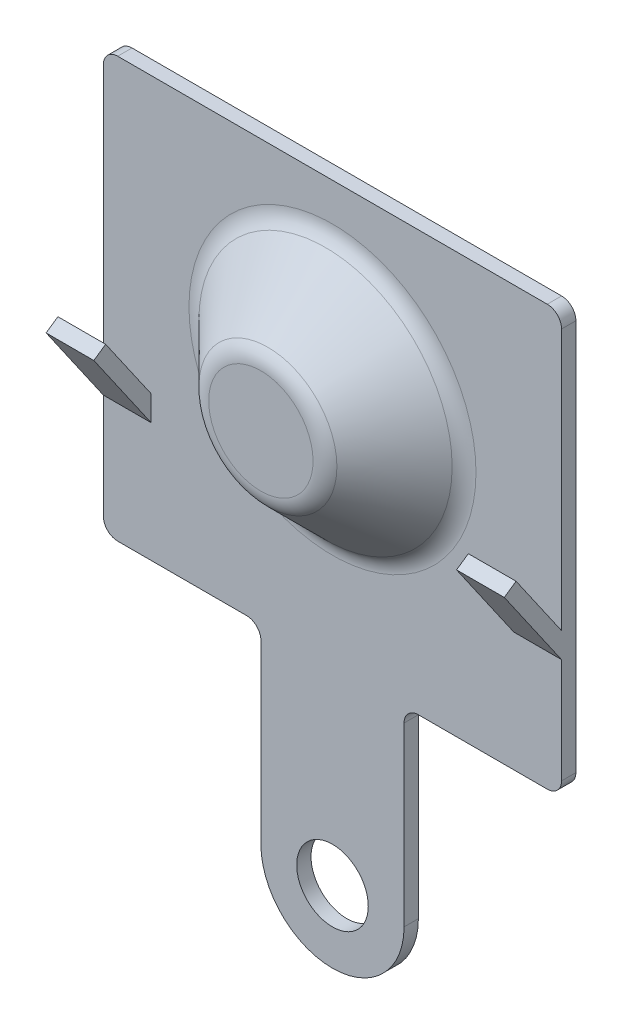
ISO-10303-21;
HEADER;
FILE_DESCRIPTION(('STEP AP214'),'2;1');
FILE_NAME('part.step','',(''),(''),'','','');
FILE_SCHEMA(('AUTOMOTIVE_DESIGN { 1 0 10303 214 1 1 1 1 }'));
ENDSEC;
DATA;
#1=APPLICATION_CONTEXT('core data for automotive mechanical design processes');
#2=APPLICATION_PROTOCOL_DEFINITION('international standard','automotive_design',2000,#1);
#3=PRODUCT_CONTEXT('',#1,'mechanical');
#4=PRODUCT('Part','Part','',(#3));
#5=PRODUCT_RELATED_PRODUCT_CATEGORY('part','',(#4));
#6=PRODUCT_DEFINITION_FORMATION('','',#4);
#7=PRODUCT_DEFINITION_CONTEXT('part definition',#1,'design');
#8=PRODUCT_DEFINITION('design','',#6,#7);
#9=PRODUCT_DEFINITION_SHAPE('','',#8);
#10=(LENGTH_UNIT() NAMED_UNIT(*) SI_UNIT(.MILLI.,.METRE.));
#11=(NAMED_UNIT(*) PLANE_ANGLE_UNIT() SI_UNIT($,.RADIAN.));
#12=(NAMED_UNIT(*) SI_UNIT($,.STERADIAN.) SOLID_ANGLE_UNIT());
#13=UNCERTAINTY_MEASURE_WITH_UNIT(LENGTH_MEASURE(1.E-05),#10,'distance_accuracy_value','');
#14=(GEOMETRIC_REPRESENTATION_CONTEXT(3) GLOBAL_UNCERTAINTY_ASSIGNED_CONTEXT((#13)) GLOBAL_UNIT_ASSIGNED_CONTEXT((#10,
#11,#12)) REPRESENTATION_CONTEXT('',''));
#15=CARTESIAN_POINT('',(0.,0.,0.));
#16=DIRECTION('',(0.,0.,1.));
#17=DIRECTION('',(1.,0.,0.));
#18=AXIS2_PLACEMENT_3D('',#15,#16,#17);
#19=CARTESIAN_POINT('',(0.,-8.4,0.3));
#20=DIRECTION('',(0.,0.,-1.));
#21=DIRECTION('',(-1.,0.,0.));
#22=AXIS2_PLACEMENT_3D('',#19,#20,#21);
#23=PLANE('',#22);
#24=CARTESIAN_POINT('',(0.,0.6,0.3));
#25=DIRECTION('',(0.,0.,-1.));
#26=DIRECTION('',(-1.,0.,0.));
#27=AXIS2_PLACEMENT_3D('',#24,#25,#26);
#28=CIRCLE('',#27,3.00710678118655);
#29=CARTESIAN_POINT('',(-3.00710678118655,0.6,0.3));
#30=VERTEX_POINT('',#29);
#31=EDGE_CURVE('E358',#30,#30,#28,.T.);
#32=ORIENTED_EDGE('',*,*,#31,.T.);
#33=EDGE_LOOP('',(#32));
#34=FACE_BOUND('',#33,.T.);
#35=CARTESIAN_POINT('',(0.,-8.4,0.3));
#36=DIRECTION('',(0.,0.,1.));
#37=DIRECTION('',(1.,0.,0.));
#38=AXIS2_PLACEMENT_3D('',#35,#36,#37);
#39=CIRCLE('',#38,0.75);
#40=CARTESIAN_POINT('',(0.750000000000001,-8.4,0.3));
#41=VERTEX_POINT('',#40);
#42=EDGE_CURVE('E246',#41,#41,#39,.T.);
#43=ORIENTED_EDGE('',*,*,#42,.F.);
#44=EDGE_LOOP('',(#43));
#45=FACE_BOUND('',#44,.T.);
#46=DIRECTION('',(-1.,0.,0.));
#47=VECTOR('',#46,1.);
#48=CARTESIAN_POINT('',(-3.8,-1.37385550395097,0.3));
#49=LINE('',#48,#47);
#50=CARTESIAN_POINT('',(-3.8,-1.37385550395097,0.3));
#51=VERTEX_POINT('',#50);
#52=CARTESIAN_POINT('',(-4.8,-1.37385550395097,0.3));
#53=VERTEX_POINT('',#52);
#54=EDGE_CURVE('E47',#51,#53,#49,.T.);
#55=ORIENTED_EDGE('',*,*,#54,.F.);
#56=DIRECTION('',(0.,1.,0.));
#57=VECTOR('',#56,1.);
#58=CARTESIAN_POINT('',(-3.8,-1.37385550395097,0.3));
#59=LINE('',#58,#57);
#60=CARTESIAN_POINT('',(-3.8,-1.9,0.3));
#61=VERTEX_POINT('',#60);
#62=EDGE_CURVE('E52',#61,#51,#59,.T.);
#63=ORIENTED_EDGE('',*,*,#62,.F.);
#64=DIRECTION('',(-1.,0.,0.));
#65=VECTOR('',#64,1.);
#66=CARTESIAN_POINT('',(-3.8,-1.9,0.3));
#67=LINE('',#66,#65);
#68=CARTESIAN_POINT('',(-4.8,-1.9,0.3));
#69=VERTEX_POINT('',#68);
#70=EDGE_CURVE('E200',#61,#69,#67,.T.);
#71=ORIENTED_EDGE('',*,*,#70,.T.);
#72=DIRECTION('',(0.,-1.,0.));
#73=VECTOR('',#72,1.);
#74=CARTESIAN_POINT('',(-4.8,4.4,0.3));
#75=LINE('',#74,#73);
#76=CARTESIAN_POINT('',(-4.8,-4.1,0.3));
#77=VERTEX_POINT('',#76);
#78=EDGE_CURVE('E273',#69,#77,#75,.T.);
#79=ORIENTED_EDGE('',*,*,#78,.T.);
#80=CARTESIAN_POINT('',(-4.5,-4.1,0.3));
#81=DIRECTION('',(0.,0.,-1.));
#82=DIRECTION('',(-1.,0.,0.));
#83=AXIS2_PLACEMENT_3D('',#80,#81,#82);
#84=CIRCLE('',#83,0.3);
#85=CARTESIAN_POINT('',(-4.5,-4.4,0.3));
#86=VERTEX_POINT('',#85);
#87=EDGE_CURVE('E335',#77,#86,#84,.F.);
#88=ORIENTED_EDGE('',*,*,#87,.T.);
#89=DIRECTION('',(1.,0.,0.));
#90=VECTOR('',#89,1.);
#91=CARTESIAN_POINT('',(-4.8,-4.4,0.3));
#92=LINE('',#91,#90);
#93=CARTESIAN_POINT('',(-1.8,-4.4,0.3));
#94=VERTEX_POINT('',#93);
#95=EDGE_CURVE('E252',#86,#94,#92,.T.);
#96=ORIENTED_EDGE('',*,*,#95,.T.);
#97=CARTESIAN_POINT('',(-1.8,-4.7,0.3));
#98=DIRECTION('',(0.,0.,-1.));
#99=DIRECTION('',(-1.,0.,0.));
#100=AXIS2_PLACEMENT_3D('',#97,#98,#99);
#101=CIRCLE('',#100,0.3);
#102=CARTESIAN_POINT('',(-1.5,-4.7,0.3));
#103=VERTEX_POINT('',#102);
#104=EDGE_CURVE('E352',#94,#103,#101,.T.);
#105=ORIENTED_EDGE('',*,*,#104,.T.);
#106=DIRECTION('',(0.,-1.,0.));
#107=VECTOR('',#106,1.);
#108=CARTESIAN_POINT('',(-1.5,-4.4,0.3));
#109=LINE('',#108,#107);
#110=CARTESIAN_POINT('',(-1.5,-8.4,0.3));
#111=VERTEX_POINT('',#110);
#112=EDGE_CURVE('E255',#103,#111,#109,.T.);
#113=ORIENTED_EDGE('',*,*,#112,.T.);
#114=CARTESIAN_POINT('',(0.,-8.4,0.3));
#115=DIRECTION('',(0.,0.,1.));
#116=DIRECTION('',(-1.,0.,0.));
#117=AXIS2_PLACEMENT_3D('',#114,#115,#116);
#118=CIRCLE('',#117,1.5);
#119=CARTESIAN_POINT('',(1.5,-8.4,0.3));
#120=VERTEX_POINT('',#119);
#121=EDGE_CURVE('E258',#111,#120,#118,.T.);
#122=ORIENTED_EDGE('',*,*,#121,.T.);
#123=DIRECTION('',(0.,1.,0.));
#124=VECTOR('',#123,1.);
#125=CARTESIAN_POINT('',(1.5,-4.4,0.3));
#126=LINE('',#125,#124);
#127=CARTESIAN_POINT('',(1.5,-4.7,0.3));
#128=VERTEX_POINT('',#127);
#129=EDGE_CURVE('E260',#120,#128,#126,.T.);
#130=ORIENTED_EDGE('',*,*,#129,.T.);
#131=CARTESIAN_POINT('',(1.8,-4.7,0.3));
#132=DIRECTION('',(0.,0.,-1.));
#133=DIRECTION('',(-1.,0.,0.));
#134=AXIS2_PLACEMENT_3D('',#131,#132,#133);
#135=CIRCLE('',#134,0.3);
#136=CARTESIAN_POINT('',(1.8,-4.4,0.3));
#137=VERTEX_POINT('',#136);
#138=EDGE_CURVE('E356',#128,#137,#135,.T.);
#139=ORIENTED_EDGE('',*,*,#138,.T.);
#140=DIRECTION('',(1.,0.,0.));
#141=VECTOR('',#140,1.);
#142=CARTESIAN_POINT('',(4.8,-4.4,0.3));
#143=LINE('',#142,#141);
#144=CARTESIAN_POINT('',(4.5,-4.4,0.3));
#145=VERTEX_POINT('',#144);
#146=EDGE_CURVE('E263',#137,#145,#143,.T.);
#147=ORIENTED_EDGE('',*,*,#146,.T.);
#148=CARTESIAN_POINT('',(4.5,-4.1,0.3));
#149=DIRECTION('',(0.,0.,-1.));
#150=DIRECTION('',(-1.,0.,0.));
#151=AXIS2_PLACEMENT_3D('',#148,#149,#150);
#152=CIRCLE('',#151,0.3);
#153=CARTESIAN_POINT('',(4.8,-4.1,0.3));
#154=VERTEX_POINT('',#153);
#155=EDGE_CURVE('E337',#145,#154,#152,.F.);
#156=ORIENTED_EDGE('',*,*,#155,.T.);
#157=DIRECTION('',(0.,1.,0.));
#158=VECTOR('',#157,1.);
#159=CARTESIAN_POINT('',(4.8,4.4,0.3));
#160=LINE('',#159,#158);
#161=CARTESIAN_POINT('',(4.8,-1.9,0.3));
#162=VERTEX_POINT('',#161);
#163=EDGE_CURVE('E267',#154,#162,#160,.T.);
#164=ORIENTED_EDGE('',*,*,#163,.T.);
#165=DIRECTION('',(1.,0.,0.));
#166=VECTOR('',#165,1.);
#167=CARTESIAN_POINT('',(3.8,-1.9,0.3));
#168=LINE('',#167,#166);
#169=CARTESIAN_POINT('',(3.8,-1.9,0.3));
#170=VERTEX_POINT('',#169);
#171=EDGE_CURVE('E237',#170,#162,#168,.T.);
#172=ORIENTED_EDGE('',*,*,#171,.F.);
#173=DIRECTION('',(0.,1.,0.));
#174=VECTOR('',#173,1.);
#175=CARTESIAN_POINT('',(3.8,-1.37385550395097,0.3));
#176=LINE('',#175,#174);
#177=CARTESIAN_POINT('',(3.8,-1.37385550395097,0.3));
#178=VERTEX_POINT('',#177);
#179=EDGE_CURVE('E216',#170,#178,#176,.T.);
#180=ORIENTED_EDGE('',*,*,#179,.T.);
#181=DIRECTION('',(1.,0.,0.));
#182=VECTOR('',#181,1.);
#183=CARTESIAN_POINT('',(3.8,-1.37385550395097,0.3));
#184=LINE('',#183,#182);
#185=CARTESIAN_POINT('',(4.8,-1.37385550395097,0.3));
#186=VERTEX_POINT('',#185);
#187=EDGE_CURVE('E229',#178,#186,#184,.T.);
#188=ORIENTED_EDGE('',*,*,#187,.T.);
#189=CARTESIAN_POINT('',(4.8,4.1,0.3));
#190=VERTEX_POINT('',#189);
#191=EDGE_CURVE('E266',#186,#190,#160,.T.);
#192=ORIENTED_EDGE('',*,*,#191,.T.);
#193=CARTESIAN_POINT('',(4.5,4.1,0.3));
#194=DIRECTION('',(0.,0.,-1.));
#195=DIRECTION('',(-1.,0.,0.));
#196=AXIS2_PLACEMENT_3D('',#193,#194,#195);
#197=CIRCLE('',#196,0.3);
#198=CARTESIAN_POINT('',(4.5,4.4,0.3));
#199=VERTEX_POINT('',#198);
#200=EDGE_CURVE('E331',#190,#199,#197,.F.);
#201=ORIENTED_EDGE('',*,*,#200,.T.);
#202=DIRECTION('',(-1.,0.,0.));
#203=VECTOR('',#202,1.);
#204=CARTESIAN_POINT('',(-4.8,4.4,0.3));
#205=LINE('',#204,#203);
#206=CARTESIAN_POINT('',(-4.5,4.4,0.3));
#207=VERTEX_POINT('',#206);
#208=EDGE_CURVE('E270',#199,#207,#205,.T.);
#209=ORIENTED_EDGE('',*,*,#208,.T.);
#210=CARTESIAN_POINT('',(-4.5,4.1,0.3));
#211=DIRECTION('',(0.,0.,-1.));
#212=DIRECTION('',(-1.,0.,0.));
#213=AXIS2_PLACEMENT_3D('',#210,#211,#212);
#214=CIRCLE('',#213,0.3);
#215=CARTESIAN_POINT('',(-4.8,4.1,0.3));
#216=VERTEX_POINT('',#215);
#217=EDGE_CURVE('E333',#207,#216,#214,.F.);
#218=ORIENTED_EDGE('',*,*,#217,.T.);
#219=EDGE_CURVE('E274',#216,#53,#75,.T.);
#220=ORIENTED_EDGE('',*,*,#219,.T.);
#221=EDGE_LOOP('',(#55,#63,#71,#79,#88,#96,#105,#113,#122,#130,#139,#147,#156,#164,#172,#180,
#188,#192,#201,#209,#218,#220));
#222=FACE_BOUND('',#221,.T.);
#223=ADVANCED_FACE('F32',(#34,#45,#222),#23,.F.);
#224=CARTESIAN_POINT('',(0.,-8.4,0.));
#225=DIRECTION('',(0.,0.,-1.));
#226=DIRECTION('',(-1.,0.,0.));
#227=AXIS2_PLACEMENT_3D('',#224,#225,#226);
#228=PLANE('',#227);
#229=DIRECTION('',(0.,1.,0.));
#230=VECTOR('',#229,1.);
#231=CARTESIAN_POINT('',(4.8,4.4,0.));
#232=LINE('',#231,#230);
#233=CARTESIAN_POINT('',(4.8,-4.1,0.));
#234=VERTEX_POINT('',#233);
#235=CARTESIAN_POINT('',(4.8,4.1,0.));
#236=VERTEX_POINT('',#235);
#237=EDGE_CURVE('E289',#234,#236,#232,.T.);
#238=ORIENTED_EDGE('',*,*,#237,.F.);
#239=CARTESIAN_POINT('',(4.5,-4.1,0.));
#240=DIRECTION('',(0.,0.,-1.));
#241=DIRECTION('',(-1.,0.,0.));
#242=AXIS2_PLACEMENT_3D('',#239,#240,#241);
#243=CIRCLE('',#242,0.3);
#244=CARTESIAN_POINT('',(4.5,-4.4,0.));
#245=VERTEX_POINT('',#244);
#246=EDGE_CURVE('E329',#234,#245,#243,.T.);
#247=ORIENTED_EDGE('',*,*,#246,.T.);
#248=DIRECTION('',(1.,0.,0.));
#249=VECTOR('',#248,1.);
#250=CARTESIAN_POINT('',(4.8,-4.4,0.));
#251=LINE('',#250,#249);
#252=CARTESIAN_POINT('',(1.8,-4.4,0.));
#253=VERTEX_POINT('',#252);
#254=EDGE_CURVE('E286',#253,#245,#251,.T.);
#255=ORIENTED_EDGE('',*,*,#254,.F.);
#256=CARTESIAN_POINT('',(1.8,-4.7,0.));
#257=DIRECTION('',(0.,0.,-1.));
#258=DIRECTION('',(-1.,0.,0.));
#259=AXIS2_PLACEMENT_3D('',#256,#257,#258);
#260=CIRCLE('',#259,0.3);
#261=CARTESIAN_POINT('',(1.5,-4.7,0.));
#262=VERTEX_POINT('',#261);
#263=EDGE_CURVE('E354',#253,#262,#260,.F.);
#264=ORIENTED_EDGE('',*,*,#263,.T.);
#265=DIRECTION('',(0.,1.,0.));
#266=VECTOR('',#265,1.);
#267=CARTESIAN_POINT('',(1.5,-4.4,0.));
#268=LINE('',#267,#266);
#269=CARTESIAN_POINT('',(1.5,-8.4,0.));
#270=VERTEX_POINT('',#269);
#271=EDGE_CURVE('E283',#270,#262,#268,.T.);
#272=ORIENTED_EDGE('',*,*,#271,.F.);
#273=CARTESIAN_POINT('',(0.,-8.4,0.));
#274=DIRECTION('',(0.,0.,1.));
#275=DIRECTION('',(-1.,0.,0.));
#276=AXIS2_PLACEMENT_3D('',#273,#274,#275);
#277=CIRCLE('',#276,1.5);
#278=CARTESIAN_POINT('',(-1.5,-8.4,0.));
#279=VERTEX_POINT('',#278);
#280=EDGE_CURVE('E281',#279,#270,#277,.T.);
#281=ORIENTED_EDGE('',*,*,#280,.F.);
#282=DIRECTION('',(0.,-1.,0.));
#283=VECTOR('',#282,1.);
#284=CARTESIAN_POINT('',(-1.5,-4.4,0.));
#285=LINE('',#284,#283);
#286=CARTESIAN_POINT('',(-1.5,-4.7,0.));
#287=VERTEX_POINT('',#286);
#288=EDGE_CURVE('E279',#287,#279,#285,.T.);
#289=ORIENTED_EDGE('',*,*,#288,.F.);
#290=CARTESIAN_POINT('',(-1.8,-4.7,0.));
#291=DIRECTION('',(0.,0.,-1.));
#292=DIRECTION('',(-1.,0.,0.));
#293=AXIS2_PLACEMENT_3D('',#290,#291,#292);
#294=CIRCLE('',#293,0.3);
#295=CARTESIAN_POINT('',(-1.8,-4.4,0.));
#296=VERTEX_POINT('',#295);
#297=EDGE_CURVE('E350',#287,#296,#294,.F.);
#298=ORIENTED_EDGE('',*,*,#297,.T.);
#299=DIRECTION('',(1.,0.,0.));
#300=VECTOR('',#299,1.);
#301=CARTESIAN_POINT('',(-4.8,-4.4,0.));
#302=LINE('',#301,#300);
#303=CARTESIAN_POINT('',(-4.5,-4.4,0.));
#304=VERTEX_POINT('',#303);
#305=EDGE_CURVE('E249',#304,#296,#302,.T.);
#306=ORIENTED_EDGE('',*,*,#305,.F.);
#307=CARTESIAN_POINT('',(-4.5,-4.1,0.));
#308=DIRECTION('',(0.,0.,-1.));
#309=DIRECTION('',(-1.,0.,0.));
#310=AXIS2_PLACEMENT_3D('',#307,#308,#309);
#311=CIRCLE('',#310,0.3);
#312=CARTESIAN_POINT('',(-4.8,-4.1,0.));
#313=VERTEX_POINT('',#312);
#314=EDGE_CURVE('E327',#304,#313,#311,.T.);
#315=ORIENTED_EDGE('',*,*,#314,.T.);
#316=DIRECTION('',(0.,-1.,0.));
#317=VECTOR('',#316,1.);
#318=CARTESIAN_POINT('',(-4.8,4.4,0.));
#319=LINE('',#318,#317);
#320=CARTESIAN_POINT('',(-4.8,4.1,0.));
#321=VERTEX_POINT('',#320);
#322=EDGE_CURVE('E256',#321,#313,#319,.T.);
#323=ORIENTED_EDGE('',*,*,#322,.F.);
#324=CARTESIAN_POINT('',(-4.5,4.1,0.));
#325=DIRECTION('',(0.,0.,-1.));
#326=DIRECTION('',(-1.,0.,0.));
#327=AXIS2_PLACEMENT_3D('',#324,#325,#326);
#328=CIRCLE('',#327,0.3);
#329=CARTESIAN_POINT('',(-4.5,4.4,0.));
#330=VERTEX_POINT('',#329);
#331=EDGE_CURVE('E325',#321,#330,#328,.T.);
#332=ORIENTED_EDGE('',*,*,#331,.T.);
#333=DIRECTION('',(-1.,0.,0.));
#334=VECTOR('',#333,1.);
#335=CARTESIAN_POINT('',(-4.8,4.4,0.));
#336=LINE('',#335,#334);
#337=CARTESIAN_POINT('',(4.5,4.4,0.));
#338=VERTEX_POINT('',#337);
#339=EDGE_CURVE('E292',#338,#330,#336,.T.);
#340=ORIENTED_EDGE('',*,*,#339,.F.);
#341=CARTESIAN_POINT('',(4.5,4.1,0.));
#342=DIRECTION('',(0.,0.,-1.));
#343=DIRECTION('',(-1.,0.,0.));
#344=AXIS2_PLACEMENT_3D('',#341,#342,#343);
#345=CIRCLE('',#344,0.3);
#346=EDGE_CURVE('E323',#338,#236,#345,.T.);
#347=ORIENTED_EDGE('',*,*,#346,.T.);
#348=EDGE_LOOP('',(#238,#247,#255,#264,#272,#281,#289,#298,#306,#315,#323,#332,#340,#347));
#349=FACE_BOUND('',#348,.T.);
#350=CARTESIAN_POINT('',(0.,-8.4,0.));
#351=DIRECTION('',(0.,0.,1.));
#352=DIRECTION('',(1.,0.,0.));
#353=AXIS2_PLACEMENT_3D('',#350,#351,#352);
#354=CIRCLE('',#353,0.75);
#355=CARTESIAN_POINT('',(0.750000000000001,-8.4,0.));
#356=VERTEX_POINT('',#355);
#357=EDGE_CURVE('E239',#356,#356,#354,.T.);
#358=ORIENTED_EDGE('',*,*,#357,.T.);
#359=EDGE_LOOP('',(#358));
#360=FACE_BOUND('',#359,.T.);
#361=ADVANCED_FACE('F376',(#349,#360),#228,.T.);
#362=CARTESIAN_POINT('',(-4.8,-4.4,0.3));
#363=DIRECTION('',(0.,1.,0.));
#364=DIRECTION('',(-1.,0.,0.));
#365=AXIS2_PLACEMENT_3D('',#362,#363,#364);
#366=PLANE('',#365);
#367=ORIENTED_EDGE('',*,*,#305,.T.);
#368=DIRECTION('',(0.,0.,-1.));
#369=VECTOR('',#368,1.);
#370=CARTESIAN_POINT('',(-1.8,-4.4,0.3));
#371=LINE('',#370,#369);
#372=EDGE_CURVE('E308',#296,#94,#371,.F.);
#373=ORIENTED_EDGE('',*,*,#372,.T.);
#374=ORIENTED_EDGE('',*,*,#95,.F.);
#375=DIRECTION('',(0.,0.,-1.));
#376=VECTOR('',#375,1.);
#377=CARTESIAN_POINT('',(-4.5,-4.4,0.3));
#378=LINE('',#377,#376);
#379=EDGE_CURVE('E305',#86,#304,#378,.T.);
#380=ORIENTED_EDGE('',*,*,#379,.T.);
#381=EDGE_LOOP('',(#367,#373,#374,#380));
#382=FACE_BOUND('',#381,.T.);
#383=ADVANCED_FACE('F389',(#382),#366,.F.);
#384=CARTESIAN_POINT('',(-1.5,-4.4,0.3));
#385=DIRECTION('',(1.,0.,0.));
#386=DIRECTION('',(0.,1.,0.));
#387=AXIS2_PLACEMENT_3D('',#384,#385,#386);
#388=PLANE('',#387);
#389=ORIENTED_EDGE('',*,*,#112,.F.);
#390=DIRECTION('',(0.,0.,-1.));
#391=VECTOR('',#390,1.);
#392=CARTESIAN_POINT('',(-1.5,-4.7,0.));
#393=LINE('',#392,#391);
#394=EDGE_CURVE('E302',#103,#287,#393,.T.);
#395=ORIENTED_EDGE('',*,*,#394,.T.);
#396=ORIENTED_EDGE('',*,*,#288,.T.);
#397=DIRECTION('',(0.,0.,-1.));
#398=VECTOR('',#397,1.);
#399=CARTESIAN_POINT('',(-1.5,-8.4,0.3));
#400=LINE('',#399,#398);
#401=EDGE_CURVE('E299',#111,#279,#400,.T.);
#402=ORIENTED_EDGE('',*,*,#401,.F.);
#403=EDGE_LOOP('',(#389,#395,#396,#402));
#404=FACE_BOUND('',#403,.T.);
#405=ADVANCED_FACE('F395',(#404),#388,.F.);
#406=CARTESIAN_POINT('',(0.,-8.4,0.3));
#407=DIRECTION('',(0.,0.,-1.));
#408=DIRECTION('',(-1.,0.,0.));
#409=AXIS2_PLACEMENT_3D('',#406,#407,#408);
#410=CYLINDRICAL_SURFACE('',#409,1.5);
#411=ORIENTED_EDGE('',*,*,#280,.T.);
#412=DIRECTION('',(0.,0.,-1.));
#413=VECTOR('',#412,1.);
#414=CARTESIAN_POINT('',(1.5,-8.4,0.3));
#415=LINE('',#414,#413);
#416=EDGE_CURVE('E276',#120,#270,#415,.T.);
#417=ORIENTED_EDGE('',*,*,#416,.F.);
#418=ORIENTED_EDGE('',*,*,#121,.F.);
#419=ORIENTED_EDGE('',*,*,#401,.T.);
#420=EDGE_LOOP('',(#411,#417,#418,#419));
#421=FACE_BOUND('',#420,.T.);
#422=ADVANCED_FACE('F418',(#421),#410,.T.);
#423=CARTESIAN_POINT('',(1.5,-4.4,0.3));
#424=DIRECTION('',(-1.,0.,0.));
#425=DIRECTION('',(0.,-1.,0.));
#426=AXIS2_PLACEMENT_3D('',#423,#424,#425);
#427=PLANE('',#426);
#428=ORIENTED_EDGE('',*,*,#271,.T.);
#429=DIRECTION('',(0.,0.,-1.));
#430=VECTOR('',#429,1.);
#431=CARTESIAN_POINT('',(1.5,-4.7,0.3));
#432=LINE('',#431,#430);
#433=EDGE_CURVE('E315',#262,#128,#432,.F.);
#434=ORIENTED_EDGE('',*,*,#433,.T.);
#435=ORIENTED_EDGE('',*,*,#129,.F.);
#436=ORIENTED_EDGE('',*,*,#416,.T.);
#437=EDGE_LOOP('',(#428,#434,#435,#436));
#438=FACE_BOUND('',#437,.T.);
#439=ADVANCED_FACE('F414',(#438),#427,.F.);
#440=CARTESIAN_POINT('',(4.8,-4.4,0.3));
#441=DIRECTION('',(0.,1.,0.));
#442=DIRECTION('',(-1.,0.,0.));
#443=AXIS2_PLACEMENT_3D('',#440,#441,#442);
#444=PLANE('',#443);
#445=ORIENTED_EDGE('',*,*,#146,.F.);
#446=DIRECTION('',(0.,0.,-1.));
#447=VECTOR('',#446,1.);
#448=CARTESIAN_POINT('',(1.8,-4.4,0.));
#449=LINE('',#448,#447);
#450=EDGE_CURVE('E312',#137,#253,#449,.T.);
#451=ORIENTED_EDGE('',*,*,#450,.T.);
#452=ORIENTED_EDGE('',*,*,#254,.T.);
#453=DIRECTION('',(0.,0.,-1.));
#454=VECTOR('',#453,1.);
#455=CARTESIAN_POINT('',(4.5,-4.4,0.3));
#456=LINE('',#455,#454);
#457=EDGE_CURVE('E310',#245,#145,#456,.F.);
#458=ORIENTED_EDGE('',*,*,#457,.T.);
#459=EDGE_LOOP('',(#445,#451,#452,#458));
#460=FACE_BOUND('',#459,.T.);
#461=ADVANCED_FACE('F410',(#460),#444,.F.);
#462=CARTESIAN_POINT('',(4.8,4.4,0.3));
#463=DIRECTION('',(-1.,0.,0.));
#464=DIRECTION('',(0.,0.,1.));
#465=AXIS2_PLACEMENT_3D('',#462,#463,#464);
#466=PLANE('',#465);
#467=ORIENTED_EDGE('',*,*,#163,.F.);
#468=DIRECTION('',(0.,0.,-1.));
#469=VECTOR('',#468,1.);
#470=CARTESIAN_POINT('',(4.8,-4.1,0.3));
#471=LINE('',#470,#469);
#472=EDGE_CURVE('E320',#154,#234,#471,.T.);
#473=ORIENTED_EDGE('',*,*,#472,.T.);
#474=ORIENTED_EDGE('',*,*,#237,.T.);
#475=DIRECTION('',(0.,0.,-1.));
#476=VECTOR('',#475,1.);
#477=CARTESIAN_POINT('',(4.8,4.1,0.3));
#478=LINE('',#477,#476);
#479=EDGE_CURVE('E317',#236,#190,#478,.F.);
#480=ORIENTED_EDGE('',*,*,#479,.T.);
#481=ORIENTED_EDGE('',*,*,#191,.F.);
#482=DIRECTION('',(0.,0.821515924632311,0.570185571174437));
#483=VECTOR('',#482,1.);
#484=CARTESIAN_POINT('',(4.8,0.,1.25354522261031));
#485=LINE('',#484,#483);
#486=CARTESIAN_POINT('',(4.8,0.,1.25354522261031));
#487=VERTEX_POINT('',#486);
#488=EDGE_CURVE('E213',#186,#487,#485,.T.);
#489=ORIENTED_EDGE('',*,*,#488,.T.);
#490=DIRECTION('',(0.,-0.570185571174436,0.821515924632312));
#491=VECTOR('',#490,1.);
#492=CARTESIAN_POINT('',(4.8,-0.17105567135233,1.5));
#493=LINE('',#492,#491);
#494=CARTESIAN_POINT('',(4.8,-0.17105567135233,1.5));
#495=VERTEX_POINT('',#494);
#496=EDGE_CURVE('E232',#487,#495,#493,.T.);
#497=ORIENTED_EDGE('',*,*,#496,.T.);
#498=DIRECTION('',(0.,-0.821515924632311,-0.570185571174436));
#499=VECTOR('',#498,1.);
#500=CARTESIAN_POINT('',(4.8,-1.9,0.3));
#501=LINE('',#500,#499);
#502=EDGE_CURVE('E220',#495,#162,#501,.T.);
#503=ORIENTED_EDGE('',*,*,#502,.T.);
#504=EDGE_LOOP('',(#467,#473,#474,#480,#481,#489,#497,#503));
#505=FACE_BOUND('',#504,.T.);
#506=ADVANCED_FACE('F406',(#505),#466,.F.);
#507=CARTESIAN_POINT('',(-4.8,4.4,0.3));
#508=DIRECTION('',(0.,-1.,0.));
#509=DIRECTION('',(0.,0.,-1.));
#510=AXIS2_PLACEMENT_3D('',#507,#508,#509);
#511=PLANE('',#510);
#512=ORIENTED_EDGE('',*,*,#339,.T.);
#513=DIRECTION('',(0.,0.,-1.));
#514=VECTOR('',#513,1.);
#515=CARTESIAN_POINT('',(-4.5,4.4,0.3));
#516=LINE('',#515,#514);
#517=EDGE_CURVE('E348',#330,#207,#516,.F.);
#518=ORIENTED_EDGE('',*,*,#517,.T.);
#519=ORIENTED_EDGE('',*,*,#208,.F.);
#520=DIRECTION('',(0.,0.,-1.));
#521=VECTOR('',#520,1.);
#522=CARTESIAN_POINT('',(4.5,4.4,0.3));
#523=LINE('',#522,#521);
#524=EDGE_CURVE('E345',#199,#338,#523,.T.);
#525=ORIENTED_EDGE('',*,*,#524,.T.);
#526=EDGE_LOOP('',(#512,#518,#519,#525));
#527=FACE_BOUND('',#526,.T.);
#528=ADVANCED_FACE('F402',(#527),#511,.F.);
#529=CARTESIAN_POINT('',(-4.8,4.4,0.3));
#530=DIRECTION('',(1.,0.,0.));
#531=DIRECTION('',(0.,0.,-1.));
#532=AXIS2_PLACEMENT_3D('',#529,#530,#531);
#533=PLANE('',#532);
#534=ORIENTED_EDGE('',*,*,#322,.T.);
#535=DIRECTION('',(0.,0.,-1.));
#536=VECTOR('',#535,1.);
#537=CARTESIAN_POINT('',(-4.8,-4.1,0.3));
#538=LINE('',#537,#536);
#539=EDGE_CURVE('E342',#313,#77,#538,.F.);
#540=ORIENTED_EDGE('',*,*,#539,.T.);
#541=ORIENTED_EDGE('',*,*,#78,.F.);
#542=DIRECTION('',(0.,-0.821515924632311,-0.570185571174436));
#543=VECTOR('',#542,1.);
#544=CARTESIAN_POINT('',(-4.8,-1.9,0.3));
#545=LINE('',#544,#543);
#546=CARTESIAN_POINT('',(-4.8,-0.17105567135233,1.5));
#547=VERTEX_POINT('',#546);
#548=EDGE_CURVE('E208',#547,#69,#545,.T.);
#549=ORIENTED_EDGE('',*,*,#548,.F.);
#550=DIRECTION('',(0.,-0.570185571174436,0.821515924632312));
#551=VECTOR('',#550,1.);
#552=CARTESIAN_POINT('',(-4.8,-0.17105567135233,1.5));
#553=LINE('',#552,#551);
#554=CARTESIAN_POINT('',(-4.8,0.,1.25354522261031));
#555=VERTEX_POINT('',#554);
#556=EDGE_CURVE('E195',#555,#547,#553,.T.);
#557=ORIENTED_EDGE('',*,*,#556,.F.);
#558=DIRECTION('',(0.,0.821515924632311,0.570185571174437));
#559=VECTOR('',#558,1.);
#560=CARTESIAN_POINT('',(-4.8,0.,1.25354522261031));
#561=LINE('',#560,#559);
#562=EDGE_CURVE('E204',#53,#555,#561,.T.);
#563=ORIENTED_EDGE('',*,*,#562,.F.);
#564=ORIENTED_EDGE('',*,*,#219,.F.);
#565=DIRECTION('',(0.,0.,-1.));
#566=VECTOR('',#565,1.);
#567=CARTESIAN_POINT('',(-4.8,4.1,0.3));
#568=LINE('',#567,#566);
#569=EDGE_CURVE('E339',#216,#321,#568,.T.);
#570=ORIENTED_EDGE('',*,*,#569,.T.);
#571=EDGE_LOOP('',(#534,#540,#541,#549,#557,#563,#564,#570));
#572=FACE_BOUND('',#571,.T.);
#573=ADVANCED_FACE('F384',(#572),#533,.F.);
#574=CARTESIAN_POINT('',(0.,-8.4,0.3));
#575=DIRECTION('',(0.,0.,-1.));
#576=DIRECTION('',(-1.,0.,0.));
#577=AXIS2_PLACEMENT_3D('',#574,#575,#576);
#578=CYLINDRICAL_SURFACE('',#577,0.75);
#579=ORIENTED_EDGE('',*,*,#42,.T.);
#580=EDGE_LOOP('',(#579));
#581=FACE_BOUND('',#580,.T.);
#582=ORIENTED_EDGE('',*,*,#357,.F.);
#583=EDGE_LOOP('',(#582));
#584=FACE_BOUND('',#583,.T.);
#585=ADVANCED_FACE('F380',(#581,#584),#578,.F.);
#586=CARTESIAN_POINT('',(-1.8,-4.7,0.3));
#587=DIRECTION('',(0.,0.,1.));
#588=DIRECTION('',(1.,0.,0.));
#589=AXIS2_PLACEMENT_3D('',#586,#587,#588);
#590=CYLINDRICAL_SURFACE('',#589,0.3);
#591=ORIENTED_EDGE('',*,*,#104,.F.);
#592=ORIENTED_EDGE('',*,*,#372,.F.);
#593=ORIENTED_EDGE('',*,*,#297,.F.);
#594=ORIENTED_EDGE('',*,*,#394,.F.);
#595=EDGE_LOOP('',(#591,#592,#593,#594));
#596=FACE_BOUND('',#595,.T.);
#597=ADVANCED_FACE('F383',(#596),#590,.F.);
#598=CARTESIAN_POINT('',(1.8,-4.7,0.3));
#599=DIRECTION('',(0.,0.,1.));
#600=DIRECTION('',(1.,0.,0.));
#601=AXIS2_PLACEMENT_3D('',#598,#599,#600);
#602=CYLINDRICAL_SURFACE('',#601,0.3);
#603=ORIENTED_EDGE('',*,*,#138,.F.);
#604=ORIENTED_EDGE('',*,*,#433,.F.);
#605=ORIENTED_EDGE('',*,*,#263,.F.);
#606=ORIENTED_EDGE('',*,*,#450,.F.);
#607=EDGE_LOOP('',(#603,#604,#605,#606));
#608=FACE_BOUND('',#607,.T.);
#609=ADVANCED_FACE('F428',(#608),#602,.F.);
#610=CARTESIAN_POINT('',(4.5,-4.1,0.3));
#611=DIRECTION('',(0.,0.,-1.));
#612=DIRECTION('',(-1.,0.,0.));
#613=AXIS2_PLACEMENT_3D('',#610,#611,#612);
#614=CYLINDRICAL_SURFACE('',#613,0.3);
#615=ORIENTED_EDGE('',*,*,#155,.F.);
#616=ORIENTED_EDGE('',*,*,#457,.F.);
#617=ORIENTED_EDGE('',*,*,#246,.F.);
#618=ORIENTED_EDGE('',*,*,#472,.F.);
#619=EDGE_LOOP('',(#615,#616,#617,#618));
#620=FACE_BOUND('',#619,.T.);
#621=ADVANCED_FACE('F432',(#620),#614,.T.);
#622=CARTESIAN_POINT('',(-4.5,-4.1,0.3));
#623=DIRECTION('',(0.,0.,-1.));
#624=DIRECTION('',(-1.,0.,0.));
#625=AXIS2_PLACEMENT_3D('',#622,#623,#624);
#626=CYLINDRICAL_SURFACE('',#625,0.3);
#627=ORIENTED_EDGE('',*,*,#87,.F.);
#628=ORIENTED_EDGE('',*,*,#539,.F.);
#629=ORIENTED_EDGE('',*,*,#314,.F.);
#630=ORIENTED_EDGE('',*,*,#379,.F.);
#631=EDGE_LOOP('',(#627,#628,#629,#630));
#632=FACE_BOUND('',#631,.T.);
#633=ADVANCED_FACE('F436',(#632),#626,.T.);
#634=CARTESIAN_POINT('',(-4.5,4.1,0.3));
#635=DIRECTION('',(0.,0.,-1.));
#636=DIRECTION('',(-1.,0.,0.));
#637=AXIS2_PLACEMENT_3D('',#634,#635,#636);
#638=CYLINDRICAL_SURFACE('',#637,0.3);
#639=ORIENTED_EDGE('',*,*,#217,.F.);
#640=ORIENTED_EDGE('',*,*,#517,.F.);
#641=ORIENTED_EDGE('',*,*,#331,.F.);
#642=ORIENTED_EDGE('',*,*,#569,.F.);
#643=EDGE_LOOP('',(#639,#640,#641,#642));
#644=FACE_BOUND('',#643,.T.);
#645=ADVANCED_FACE('F440',(#644),#638,.T.);
#646=CARTESIAN_POINT('',(4.5,4.1,0.3));
#647=DIRECTION('',(0.,0.,-1.));
#648=DIRECTION('',(-1.,0.,0.));
#649=AXIS2_PLACEMENT_3D('',#646,#647,#648);
#650=CYLINDRICAL_SURFACE('',#649,0.3);
#651=ORIENTED_EDGE('',*,*,#200,.F.);
#652=ORIENTED_EDGE('',*,*,#479,.F.);
#653=ORIENTED_EDGE('',*,*,#346,.F.);
#654=ORIENTED_EDGE('',*,*,#524,.F.);
#655=EDGE_LOOP('',(#651,#652,#653,#654));
#656=FACE_BOUND('',#655,.T.);
#657=ADVANCED_FACE('F444',(#656),#650,.T.);
#658=CARTESIAN_POINT('',(3.8,-1.9,0.3));
#659=DIRECTION('',(0.,-0.570185571174436,0.821515924632311));
#660=DIRECTION('',(0.,-0.821515924632312,-0.570185571174436));
#661=AXIS2_PLACEMENT_3D('',#658,#659,#660);
#662=PLANE('',#661);
#663=ORIENTED_EDGE('',*,*,#502,.F.);
#664=DIRECTION('',(1.,0.,0.));
#665=VECTOR('',#664,1.);
#666=CARTESIAN_POINT('',(3.8,-0.17105567135233,1.5));
#667=LINE('',#666,#665);
#668=CARTESIAN_POINT('',(3.8,-0.17105567135233,1.5));
#669=VERTEX_POINT('',#668);
#670=EDGE_CURVE('E240',#669,#495,#667,.T.);
#671=ORIENTED_EDGE('',*,*,#670,.F.);
#672=DIRECTION('',(0.,-0.821515924632311,-0.570185571174436));
#673=VECTOR('',#672,1.);
#674=CARTESIAN_POINT('',(3.8,-1.9,0.3));
#675=LINE('',#674,#673);
#676=EDGE_CURVE('E226',#669,#170,#675,.T.);
#677=ORIENTED_EDGE('',*,*,#676,.T.);
#678=ORIENTED_EDGE('',*,*,#171,.T.);
#679=EDGE_LOOP('',(#663,#671,#677,#678));
#680=FACE_BOUND('',#679,.T.);
#681=ADVANCED_FACE('F447',(#680),#662,.T.);
#682=CARTESIAN_POINT('',(3.8,-0.17105567135233,1.5));
#683=DIRECTION('',(0.,0.821515924632312,0.570185571174436));
#684=DIRECTION('',(0.,-0.570185571174436,0.821515924632312));
#685=AXIS2_PLACEMENT_3D('',#682,#683,#684);
#686=PLANE('',#685);
#687=ORIENTED_EDGE('',*,*,#496,.F.);
#688=DIRECTION('',(1.,0.,0.));
#689=VECTOR('',#688,1.);
#690=CARTESIAN_POINT('',(3.8,0.,1.25354522261031));
#691=LINE('',#690,#689);
#692=CARTESIAN_POINT('',(3.8,0.,1.25354522261031));
#693=VERTEX_POINT('',#692);
#694=EDGE_CURVE('E242',#693,#487,#691,.T.);
#695=ORIENTED_EDGE('',*,*,#694,.F.);
#696=DIRECTION('',(0.,-0.570185571174436,0.821515924632312));
#697=VECTOR('',#696,1.);
#698=CARTESIAN_POINT('',(3.8,-0.17105567135233,1.5));
#699=LINE('',#698,#697);
#700=EDGE_CURVE('E223',#693,#669,#699,.T.);
#701=ORIENTED_EDGE('',*,*,#700,.T.);
#702=ORIENTED_EDGE('',*,*,#670,.T.);
#703=EDGE_LOOP('',(#687,#695,#701,#702));
#704=FACE_BOUND('',#703,.T.);
#705=ADVANCED_FACE('F452',(#704),#686,.T.);
#706=CARTESIAN_POINT('',(3.8,0.,1.25354522261031));
#707=DIRECTION('',(0.,0.570185571174437,-0.821515924632311));
#708=DIRECTION('',(0.,0.821515924632311,0.570185571174437));
#709=AXIS2_PLACEMENT_3D('',#706,#707,#708);
#710=PLANE('',#709);
#711=ORIENTED_EDGE('',*,*,#488,.F.);
#712=ORIENTED_EDGE('',*,*,#187,.F.);
#713=DIRECTION('',(0.,0.821515924632311,0.570185571174437));
#714=VECTOR('',#713,1.);
#715=CARTESIAN_POINT('',(3.8,0.,1.25354522261031));
#716=LINE('',#715,#714);
#717=EDGE_CURVE('E219',#178,#693,#716,.T.);
#718=ORIENTED_EDGE('',*,*,#717,.T.);
#719=ORIENTED_EDGE('',*,*,#694,.T.);
#720=EDGE_LOOP('',(#711,#712,#718,#719));
#721=FACE_BOUND('',#720,.T.);
#722=ADVANCED_FACE('F477',(#721),#710,.T.);
#723=CARTESIAN_POINT('',(3.8,0.,0.));
#724=DIRECTION('',(1.,0.,0.));
#725=DIRECTION('',(0.,0.,-1.));
#726=AXIS2_PLACEMENT_3D('',#723,#724,#725);
#727=PLANE('',#726);
#728=ORIENTED_EDGE('',*,*,#179,.F.);
#729=ORIENTED_EDGE('',*,*,#676,.F.);
#730=ORIENTED_EDGE('',*,*,#700,.F.);
#731=ORIENTED_EDGE('',*,*,#717,.F.);
#732=EDGE_LOOP('',(#728,#729,#730,#731));
#733=FACE_BOUND('',#732,.T.);
#734=ADVANCED_FACE('F470',(#733),#727,.F.);
#735=CARTESIAN_POINT('',(-3.8,0.,1.25354522261031));
#736=DIRECTION('',(0.,-0.570185571174437,0.821515924632311));
#737=DIRECTION('',(0.,-0.821515924632311,-0.570185571174437));
#738=AXIS2_PLACEMENT_3D('',#735,#736,#737);
#739=PLANE('',#738);
#740=ORIENTED_EDGE('',*,*,#562,.T.);
#741=DIRECTION('',(-1.,0.,0.));
#742=VECTOR('',#741,1.);
#743=CARTESIAN_POINT('',(-3.8,0.,1.25354522261031));
#744=LINE('',#743,#742);
#745=CARTESIAN_POINT('',(-3.8,0.,1.25354522261031));
#746=VERTEX_POINT('',#745);
#747=EDGE_CURVE('E199',#746,#555,#744,.T.);
#748=ORIENTED_EDGE('',*,*,#747,.F.);
#749=DIRECTION('',(0.,0.821515924632311,0.570185571174437));
#750=VECTOR('',#749,1.);
#751=CARTESIAN_POINT('',(-3.8,0.,1.25354522261031));
#752=LINE('',#751,#750);
#753=EDGE_CURVE('E186',#51,#746,#752,.T.);
#754=ORIENTED_EDGE('',*,*,#753,.F.);
#755=ORIENTED_EDGE('',*,*,#54,.T.);
#756=EDGE_LOOP('',(#740,#748,#754,#755));
#757=FACE_BOUND('',#756,.T.);
#758=ADVANCED_FACE('F468',(#757),#739,.F.);
#759=CARTESIAN_POINT('',(-3.8,-0.17105567135233,1.5));
#760=DIRECTION('',(0.,-0.821515924632312,-0.570185571174436));
#761=DIRECTION('',(0.,0.570185571174436,-0.821515924632312));
#762=AXIS2_PLACEMENT_3D('',#759,#760,#761);
#763=PLANE('',#762);
#764=ORIENTED_EDGE('',*,*,#556,.T.);
#765=DIRECTION('',(-1.,0.,0.));
#766=VECTOR('',#765,1.);
#767=CARTESIAN_POINT('',(-3.8,-0.17105567135233,1.5));
#768=LINE('',#767,#766);
#769=CARTESIAN_POINT('',(-3.8,-0.17105567135233,1.5));
#770=VERTEX_POINT('',#769);
#771=EDGE_CURVE('E192',#770,#547,#768,.T.);
#772=ORIENTED_EDGE('',*,*,#771,.F.);
#773=DIRECTION('',(0.,-0.570185571174436,0.821515924632312));
#774=VECTOR('',#773,1.);
#775=CARTESIAN_POINT('',(-3.8,-0.17105567135233,1.5));
#776=LINE('',#775,#774);
#777=EDGE_CURVE('E180',#746,#770,#776,.T.);
#778=ORIENTED_EDGE('',*,*,#777,.F.);
#779=ORIENTED_EDGE('',*,*,#747,.T.);
#780=EDGE_LOOP('',(#764,#772,#778,#779));
#781=FACE_BOUND('',#780,.T.);
#782=ADVANCED_FACE('F193',(#781),#763,.F.);
#783=CARTESIAN_POINT('',(-3.8,-1.9,0.3));
#784=DIRECTION('',(0.,0.570185571174436,-0.821515924632311));
#785=DIRECTION('',(0.,0.821515924632312,0.570185571174436));
#786=AXIS2_PLACEMENT_3D('',#783,#784,#785);
#787=PLANE('',#786);
#788=ORIENTED_EDGE('',*,*,#548,.T.);
#789=ORIENTED_EDGE('',*,*,#70,.F.);
#790=DIRECTION('',(0.,-0.821515924632311,-0.570185571174436));
#791=VECTOR('',#790,1.);
#792=CARTESIAN_POINT('',(-3.8,-1.9,0.3));
#793=LINE('',#792,#791);
#794=EDGE_CURVE('E184',#770,#61,#793,.T.);
#795=ORIENTED_EDGE('',*,*,#794,.F.);
#796=ORIENTED_EDGE('',*,*,#771,.T.);
#797=EDGE_LOOP('',(#788,#789,#795,#796));
#798=FACE_BOUND('',#797,.T.);
#799=ADVANCED_FACE('F202',(#798),#787,.F.);
#800=CARTESIAN_POINT('',(-3.8,0.,0.));
#801=DIRECTION('',(-1.,0.,0.));
#802=DIRECTION('',(0.,0.,-1.));
#803=AXIS2_PLACEMENT_3D('',#800,#801,#802);
#804=PLANE('',#803);
#805=ORIENTED_EDGE('',*,*,#62,.T.);
#806=ORIENTED_EDGE('',*,*,#753,.T.);
#807=ORIENTED_EDGE('',*,*,#777,.T.);
#808=ORIENTED_EDGE('',*,*,#794,.T.);
#809=EDGE_LOOP('',(#805,#806,#807,#808));
#810=FACE_BOUND('',#809,.T.);
#811=ADVANCED_FACE('F182',(#810),#804,.F.);
#812=CARTESIAN_POINT('',(0.,0.6,1.8));
#813=DIRECTION('',(0.,0.,1.));
#814=DIRECTION('',(0.,-1.,0.));
#815=AXIS2_PLACEMENT_3D('',#812,#813,#814);
#816=PLANE('',#815);
#817=CARTESIAN_POINT('',(0.,0.6,1.8));
#818=DIRECTION('',(0.,0.,1.));
#819=DIRECTION('',(0.,-1.,0.));
#820=AXIS2_PLACEMENT_3D('',#817,#818,#819);
#821=CIRCLE('',#820,1.09289321881345);
#822=CARTESIAN_POINT('',(0.,-0.492893218813452,1.8));
#823=VERTEX_POINT('',#822);
#824=EDGE_CURVE('E11',#823,#823,#821,.T.);
#825=ORIENTED_EDGE('',*,*,#824,.T.);
#826=EDGE_LOOP('',(#825));
#827=FACE_BOUND('',#826,.T.);
#828=ADVANCED_FACE('F562',(#827),#816,.T.);
#829=CARTESIAN_POINT('',(0.,0.6,0.3));
#830=DIRECTION('',(0.,0.,-1.));
#831=DIRECTION('',(0.,1.,0.));
#832=AXIS2_PLACEMENT_3D('',#829,#830,#831);
#833=CONICAL_SURFACE('',#832,2.8,0.785398163397448);
#834=CARTESIAN_POINT('',(0.,0.6,0.446446609406727));
#835=DIRECTION('',(0.,0.,1.));
#836=DIRECTION('',(1.,0.,0.));
#837=AXIS2_PLACEMENT_3D('',#834,#835,#836);
#838=CIRCLE('',#837,2.65355339059327);
#839=CARTESIAN_POINT('',(2.65355339059327,0.6,0.446446609406727));
#840=VERTEX_POINT('',#839);
#841=EDGE_CURVE('E40',#840,#840,#838,.T.);
#842=ORIENTED_EDGE('',*,*,#841,.T.);
#843=EDGE_LOOP('',(#842));
#844=FACE_BOUND('',#843,.T.);
#845=CARTESIAN_POINT('',(0.,0.6,1.65355339059327));
#846=DIRECTION('',(0.,0.,1.));
#847=DIRECTION('',(0.,-1.,0.));
#848=AXIS2_PLACEMENT_3D('',#845,#846,#847);
#849=CIRCLE('',#848,1.44644660940673);
#850=CARTESIAN_POINT('',(0.,-0.846446609406726,1.65355339059327));
#851=VERTEX_POINT('',#850);
#852=EDGE_CURVE('E361',#851,#851,#849,.F.);
#853=ORIENTED_EDGE('',*,*,#852,.T.);
#854=EDGE_LOOP('',(#853));
#855=FACE_BOUND('',#854,.T.);
#856=ADVANCED_FACE('F366',(#844,#855),#833,.T.);
#857=CARTESIAN_POINT('',(0.,0.6,0.8));
#858=DIRECTION('',(0.,0.,-1.));
#859=DIRECTION('',(-1.,0.,0.));
#860=AXIS2_PLACEMENT_3D('',#857,#858,#859);
#861=TOROIDAL_SURFACE('',#860,3.00710678118655,0.5);
#862=ORIENTED_EDGE('',*,*,#841,.F.);
#863=EDGE_LOOP('',(#862));
#864=FACE_BOUND('',#863,.T.);
#865=ORIENTED_EDGE('',*,*,#31,.F.);
#866=EDGE_LOOP('',(#865));
#867=FACE_BOUND('',#866,.T.);
#868=ADVANCED_FACE('F369',(#864,#867),#861,.F.);
#869=CARTESIAN_POINT('',(0.,0.6,1.3));
#870=DIRECTION('',(0.,0.,1.));
#871=DIRECTION('',(0.,-1.,0.));
#872=AXIS2_PLACEMENT_3D('',#869,#870,#871);
#873=TOROIDAL_SURFACE('',#872,1.09289321881345,0.5);
#874=ORIENTED_EDGE('',*,*,#824,.F.);
#875=EDGE_LOOP('',(#874));
#876=FACE_BOUND('',#875,.T.);
#877=ORIENTED_EDGE('',*,*,#852,.F.);
#878=EDGE_LOOP('',(#877));
#879=FACE_BOUND('',#878,.T.);
#880=ADVANCED_FACE('F34',(#876,#879),#873,.T.);
#881=CLOSED_SHELL('',(#223,#361,#383,#405,#422,#439,#461,#506,#528,#573,#585,#597,#609,#621,
#633,#645,#657,#681,#705,#722,#734,#758,#782,#799,#811,#828,#856,#868,#880));
#882=MANIFOLD_SOLID_BREP('B2',#881);
#883=ADVANCED_BREP_SHAPE_REPRESENTATION('',(#18,#882),#14);
#884=SHAPE_DEFINITION_REPRESENTATION(#9,#883);
ENDSEC;
END-ISO-10303-21;
